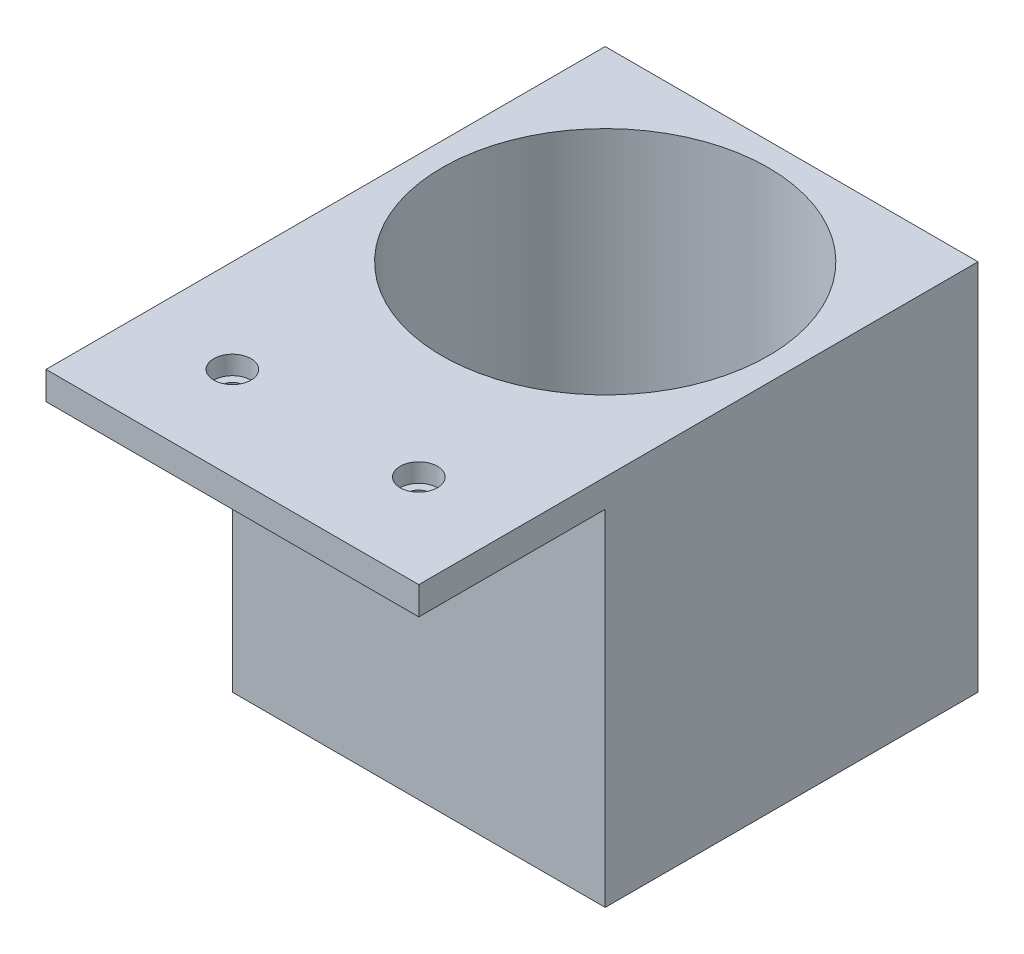
ISO-10303-21;
HEADER;
FILE_DESCRIPTION(('STEP AP214'),'2;1');
FILE_NAME('part.step','',(''),(''),'','','');
FILE_SCHEMA(('AUTOMOTIVE_DESIGN { 1 0 10303 214 1 1 1 1 }'));
ENDSEC;
DATA;
#1=APPLICATION_CONTEXT('core data for automotive mechanical design processes');
#2=APPLICATION_PROTOCOL_DEFINITION('international standard','automotive_design',2000,#1);
#3=PRODUCT_CONTEXT('',#1,'mechanical');
#4=PRODUCT('Part','Part','',(#3));
#5=PRODUCT_RELATED_PRODUCT_CATEGORY('part','',(#4));
#6=PRODUCT_DEFINITION_FORMATION('','',#4);
#7=PRODUCT_DEFINITION_CONTEXT('part definition',#1,'design');
#8=PRODUCT_DEFINITION('design','',#6,#7);
#9=PRODUCT_DEFINITION_SHAPE('','',#8);
#10=(LENGTH_UNIT() NAMED_UNIT(*) SI_UNIT(.MILLI.,.METRE.));
#11=(NAMED_UNIT(*) PLANE_ANGLE_UNIT() SI_UNIT($,.RADIAN.));
#12=(NAMED_UNIT(*) SI_UNIT($,.STERADIAN.) SOLID_ANGLE_UNIT());
#13=UNCERTAINTY_MEASURE_WITH_UNIT(LENGTH_MEASURE(1.E-05),#10,'distance_accuracy_value','');
#14=(GEOMETRIC_REPRESENTATION_CONTEXT(3) GLOBAL_UNCERTAINTY_ASSIGNED_CONTEXT((#13)) GLOBAL_UNIT_ASSIGNED_CONTEXT((#10,
#11,#12)) REPRESENTATION_CONTEXT('',''));
#15=CARTESIAN_POINT('',(0.,0.,0.));
#16=DIRECTION('',(0.,0.,1.));
#17=DIRECTION('',(1.,0.,0.));
#18=AXIS2_PLACEMENT_3D('',#15,#16,#17);
#19=CARTESIAN_POINT('',(80.,6.,0.));
#20=DIRECTION('',(0.,-1.,0.));
#21=DIRECTION('',(0.,0.,-1.));
#22=AXIS2_PLACEMENT_3D('',#19,#20,#21);
#23=PLANE('',#22);
#24=CARTESIAN_POINT('',(60.,6.,20.));
#25=DIRECTION('',(0.,1.,0.));
#26=DIRECTION('',(0.,0.,1.));
#27=AXIS2_PLACEMENT_3D('',#24,#25,#26);
#28=CIRCLE('',#27,3.99999999999999);
#29=CARTESIAN_POINT('',(60.,6.,24.));
#30=VERTEX_POINT('',#29);
#31=EDGE_CURVE('E196',#30,#30,#28,.T.);
#32=ORIENTED_EDGE('',*,*,#31,.F.);
#33=EDGE_LOOP('',(#32));
#34=FACE_BOUND('',#33,.T.);
#35=CARTESIAN_POINT('',(40.,6.00000000000001,-40.));
#36=DIRECTION('',(0.,-1.,0.));
#37=DIRECTION('',(0.,0.,-1.));
#38=AXIS2_PLACEMENT_3D('',#35,#36,#37);
#39=CIRCLE('',#38,35.);
#40=CARTESIAN_POINT('',(40.,6.00000000000001,-75.));
#41=VERTEX_POINT('',#40);
#42=EDGE_CURVE('E50',#41,#41,#39,.T.);
#43=ORIENTED_EDGE('',*,*,#42,.T.);
#44=EDGE_LOOP('',(#43));
#45=FACE_BOUND('',#44,.T.);
#46=DIRECTION('',(-1.,0.,0.));
#47=VECTOR('',#46,1.);
#48=CARTESIAN_POINT('',(80.,6.,40.));
#49=LINE('',#48,#47);
#50=CARTESIAN_POINT('',(80.,6.,40.));
#51=VERTEX_POINT('',#50);
#52=CARTESIAN_POINT('',(0.,6.,40.));
#53=VERTEX_POINT('',#52);
#54=EDGE_CURVE('E12',#51,#53,#49,.T.);
#55=ORIENTED_EDGE('',*,*,#54,.F.);
#56=DIRECTION('',(0.,0.,1.));
#57=VECTOR('',#56,1.);
#58=CARTESIAN_POINT('',(80.,6.,0.));
#59=LINE('',#58,#57);
#60=CARTESIAN_POINT('',(80.,6.00000000000001,-80.));
#61=VERTEX_POINT('',#60);
#62=EDGE_CURVE('E86',#61,#51,#59,.T.);
#63=ORIENTED_EDGE('',*,*,#62,.F.);
#64=DIRECTION('',(-1.,0.,0.));
#65=VECTOR('',#64,1.);
#66=CARTESIAN_POINT('',(0.,6.00000000000001,-80.));
#67=LINE('',#66,#65);
#68=CARTESIAN_POINT('',(0.,6.00000000000001,-80.));
#69=VERTEX_POINT('',#68);
#70=EDGE_CURVE('E130',#61,#69,#67,.T.);
#71=ORIENTED_EDGE('',*,*,#70,.T.);
#72=DIRECTION('',(0.,0.,1.));
#73=VECTOR('',#72,1.);
#74=CARTESIAN_POINT('',(0.,6.,0.));
#75=LINE('',#74,#73);
#76=EDGE_CURVE('E147',#69,#53,#75,.T.);
#77=ORIENTED_EDGE('',*,*,#76,.T.);
#78=EDGE_LOOP('',(#55,#63,#71,#77));
#79=FACE_BOUND('',#78,.T.);
#80=CARTESIAN_POINT('',(20.,6.,20.));
#81=DIRECTION('',(0.,1.,0.));
#82=DIRECTION('',(0.,0.,1.));
#83=AXIS2_PLACEMENT_3D('',#80,#81,#82);
#84=CIRCLE('',#83,3.99999999999999);
#85=CARTESIAN_POINT('',(20.,6.,24.));
#86=VERTEX_POINT('',#85);
#87=EDGE_CURVE('E203',#86,#86,#84,.T.);
#88=ORIENTED_EDGE('',*,*,#87,.F.);
#89=EDGE_LOOP('',(#88));
#90=FACE_BOUND('',#89,.T.);
#91=ADVANCED_FACE('F47',(#34,#45,#79,#90),#23,.F.);
#92=CARTESIAN_POINT('',(80.,0.,40.));
#93=DIRECTION('',(0.,0.,1.));
#94=DIRECTION('',(1.,0.,0.));
#95=AXIS2_PLACEMENT_3D('',#92,#93,#94);
#96=PLANE('',#95);
#97=DIRECTION('',(0.,1.,0.));
#98=VECTOR('',#97,1.);
#99=CARTESIAN_POINT('',(0.,0.,40.));
#100=LINE('',#99,#98);
#101=CARTESIAN_POINT('',(0.,0.,40.));
#102=VERTEX_POINT('',#101);
#103=EDGE_CURVE('E164',#102,#53,#100,.T.);
#104=ORIENTED_EDGE('',*,*,#103,.F.);
#105=DIRECTION('',(-1.,0.,0.));
#106=VECTOR('',#105,1.);
#107=CARTESIAN_POINT('',(80.,0.,40.));
#108=LINE('',#107,#106);
#109=CARTESIAN_POINT('',(80.,0.,40.));
#110=VERTEX_POINT('',#109);
#111=EDGE_CURVE('E57',#110,#102,#108,.T.);
#112=ORIENTED_EDGE('',*,*,#111,.F.);
#113=DIRECTION('',(0.,1.,0.));
#114=VECTOR('',#113,1.);
#115=CARTESIAN_POINT('',(80.,0.,40.));
#116=LINE('',#115,#114);
#117=EDGE_CURVE('E152',#110,#51,#116,.T.);
#118=ORIENTED_EDGE('',*,*,#117,.T.);
#119=ORIENTED_EDGE('',*,*,#54,.T.);
#120=EDGE_LOOP('',(#104,#112,#118,#119));
#121=FACE_BOUND('',#120,.T.);
#122=ADVANCED_FACE('F175',(#121),#96,.T.);
#123=CARTESIAN_POINT('',(80.,0.,0.));
#124=DIRECTION('',(0.,-1.,0.));
#125=DIRECTION('',(0.,0.,-1.));
#126=AXIS2_PLACEMENT_3D('',#123,#124,#125);
#127=PLANE('',#126);
#128=CARTESIAN_POINT('',(20.,0.,20.));
#129=DIRECTION('',(0.,-1.,0.));
#130=DIRECTION('',(0.,0.,-1.));
#131=AXIS2_PLACEMENT_3D('',#128,#129,#130);
#132=CIRCLE('',#131,2.25);
#133=CARTESIAN_POINT('',(20.,0.,17.75));
#134=VERTEX_POINT('',#133);
#135=EDGE_CURVE('E216',#134,#134,#132,.T.);
#136=ORIENTED_EDGE('',*,*,#135,.F.);
#137=EDGE_LOOP('',(#136));
#138=FACE_BOUND('',#137,.T.);
#139=CARTESIAN_POINT('',(60.,0.,20.));
#140=DIRECTION('',(0.,-1.,0.));
#141=DIRECTION('',(0.,0.,-1.));
#142=AXIS2_PLACEMENT_3D('',#139,#140,#141);
#143=CIRCLE('',#142,2.25);
#144=CARTESIAN_POINT('',(60.,0.,17.75));
#145=VERTEX_POINT('',#144);
#146=EDGE_CURVE('E229',#145,#145,#143,.T.);
#147=ORIENTED_EDGE('',*,*,#146,.F.);
#148=EDGE_LOOP('',(#147));
#149=FACE_BOUND('',#148,.T.);
#150=DIRECTION('',(0.,0.,1.));
#151=VECTOR('',#150,1.);
#152=CARTESIAN_POINT('',(0.,0.,0.));
#153=LINE('',#152,#151);
#154=CARTESIAN_POINT('',(0.,0.,0.));
#155=VERTEX_POINT('',#154);
#156=EDGE_CURVE('E113',#155,#102,#153,.T.);
#157=ORIENTED_EDGE('',*,*,#156,.F.);
#158=DIRECTION('',(-1.,0.,0.));
#159=VECTOR('',#158,1.);
#160=CARTESIAN_POINT('',(80.,0.,0.));
#161=LINE('',#160,#159);
#162=CARTESIAN_POINT('',(80.,0.,0.));
#163=VERTEX_POINT('',#162);
#164=EDGE_CURVE('E65',#163,#155,#161,.T.);
#165=ORIENTED_EDGE('',*,*,#164,.F.);
#166=DIRECTION('',(0.,0.,1.));
#167=VECTOR('',#166,1.);
#168=CARTESIAN_POINT('',(80.,0.,0.));
#169=LINE('',#168,#167);
#170=EDGE_CURVE('E156',#163,#110,#169,.T.);
#171=ORIENTED_EDGE('',*,*,#170,.T.);
#172=ORIENTED_EDGE('',*,*,#111,.T.);
#173=EDGE_LOOP('',(#157,#165,#171,#172));
#174=FACE_BOUND('',#173,.T.);
#175=ADVANCED_FACE('F173',(#138,#149,#174),#127,.T.);
#176=CARTESIAN_POINT('',(80.,-40.,0.));
#177=DIRECTION('',(0.,0.,1.));
#178=DIRECTION('',(1.,0.,0.));
#179=AXIS2_PLACEMENT_3D('',#176,#177,#178);
#180=PLANE('',#179);
#181=DIRECTION('',(0.,1.,0.));
#182=VECTOR('',#181,1.);
#183=CARTESIAN_POINT('',(0.,-40.,0.));
#184=LINE('',#183,#182);
#185=CARTESIAN_POINT('',(0.,-74.,0.));
#186=VERTEX_POINT('',#185);
#187=EDGE_CURVE('E105',#186,#155,#184,.T.);
#188=ORIENTED_EDGE('',*,*,#187,.F.);
#189=DIRECTION('',(1.,0.,0.));
#190=VECTOR('',#189,1.);
#191=CARTESIAN_POINT('',(0.,-74.,0.));
#192=LINE('',#191,#190);
#193=CARTESIAN_POINT('',(80.,-74.,0.));
#194=VERTEX_POINT('',#193);
#195=EDGE_CURVE('E108',#186,#194,#192,.T.);
#196=ORIENTED_EDGE('',*,*,#195,.T.);
#197=DIRECTION('',(0.,1.,0.));
#198=VECTOR('',#197,1.);
#199=CARTESIAN_POINT('',(80.,-40.,0.));
#200=LINE('',#199,#198);
#201=EDGE_CURVE('E159',#194,#163,#200,.T.);
#202=ORIENTED_EDGE('',*,*,#201,.T.);
#203=ORIENTED_EDGE('',*,*,#164,.T.);
#204=EDGE_LOOP('',(#188,#196,#202,#203));
#205=FACE_BOUND('',#204,.T.);
#206=ADVANCED_FACE('F107',(#205),#180,.T.);
#207=CARTESIAN_POINT('',(80.,0.,0.));
#208=DIRECTION('',(-1.,0.,0.));
#209=DIRECTION('',(0.,0.,1.));
#210=AXIS2_PLACEMENT_3D('',#207,#208,#209);
#211=PLANE('',#210);
#212=ORIENTED_EDGE('',*,*,#201,.F.);
#213=DIRECTION('',(0.,0.,-1.));
#214=VECTOR('',#213,1.);
#215=CARTESIAN_POINT('',(80.,-74.,0.));
#216=LINE('',#215,#214);
#217=CARTESIAN_POINT('',(80.,-74.,-80.));
#218=VERTEX_POINT('',#217);
#219=EDGE_CURVE('E123',#194,#218,#216,.T.);
#220=ORIENTED_EDGE('',*,*,#219,.T.);
#221=DIRECTION('',(0.,1.,0.));
#222=VECTOR('',#221,1.);
#223=CARTESIAN_POINT('',(80.,-74.,-80.));
#224=LINE('',#223,#222);
#225=EDGE_CURVE('E143',#218,#61,#224,.T.);
#226=ORIENTED_EDGE('',*,*,#225,.T.);
#227=ORIENTED_EDGE('',*,*,#62,.T.);
#228=ORIENTED_EDGE('',*,*,#117,.F.);
#229=ORIENTED_EDGE('',*,*,#170,.F.);
#230=EDGE_LOOP('',(#212,#220,#226,#227,#228,#229));
#231=FACE_BOUND('',#230,.T.);
#232=ADVANCED_FACE('F183',(#231),#211,.F.);
#233=CARTESIAN_POINT('',(0.,0.,0.));
#234=DIRECTION('',(-1.,0.,0.));
#235=DIRECTION('',(0.,0.,1.));
#236=AXIS2_PLACEMENT_3D('',#233,#234,#235);
#237=PLANE('',#236);
#238=DIRECTION('',(0.,0.,1.));
#239=VECTOR('',#238,1.);
#240=CARTESIAN_POINT('',(0.,-74.,0.));
#241=LINE('',#240,#239);
#242=CARTESIAN_POINT('',(0.,-74.,-80.));
#243=VERTEX_POINT('',#242);
#244=EDGE_CURVE('E120',#243,#186,#241,.T.);
#245=ORIENTED_EDGE('',*,*,#244,.T.);
#246=ORIENTED_EDGE('',*,*,#187,.T.);
#247=ORIENTED_EDGE('',*,*,#156,.T.);
#248=ORIENTED_EDGE('',*,*,#103,.T.);
#249=ORIENTED_EDGE('',*,*,#76,.F.);
#250=DIRECTION('',(0.,1.,0.));
#251=VECTOR('',#250,1.);
#252=CARTESIAN_POINT('',(0.,-74.,-80.));
#253=LINE('',#252,#251);
#254=EDGE_CURVE('E128',#243,#69,#253,.T.);
#255=ORIENTED_EDGE('',*,*,#254,.F.);
#256=EDGE_LOOP('',(#245,#246,#247,#248,#249,#255));
#257=FACE_BOUND('',#256,.T.);
#258=ADVANCED_FACE('F126',(#257),#237,.T.);
#259=CARTESIAN_POINT('',(0.,-74.,-80.));
#260=DIRECTION('',(0.,0.,-1.));
#261=DIRECTION('',(0.,1.,0.));
#262=AXIS2_PLACEMENT_3D('',#259,#260,#261);
#263=PLANE('',#262);
#264=ORIENTED_EDGE('',*,*,#70,.F.);
#265=ORIENTED_EDGE('',*,*,#225,.F.);
#266=DIRECTION('',(-1.,0.,0.));
#267=VECTOR('',#266,1.);
#268=CARTESIAN_POINT('',(0.,-74.,-80.));
#269=LINE('',#268,#267);
#270=EDGE_CURVE('E141',#218,#243,#269,.T.);
#271=ORIENTED_EDGE('',*,*,#270,.T.);
#272=ORIENTED_EDGE('',*,*,#254,.T.);
#273=EDGE_LOOP('',(#264,#265,#271,#272));
#274=FACE_BOUND('',#273,.T.);
#275=ADVANCED_FACE('F250',(#274),#263,.T.);
#276=CARTESIAN_POINT('',(0.,-74.,0.));
#277=DIRECTION('',(0.,-1.,0.));
#278=DIRECTION('',(0.,0.,-1.));
#279=AXIS2_PLACEMENT_3D('',#276,#277,#278);
#280=PLANE('',#279);
#281=ORIENTED_EDGE('',*,*,#244,.F.);
#282=ORIENTED_EDGE('',*,*,#270,.F.);
#283=ORIENTED_EDGE('',*,*,#219,.F.);
#284=ORIENTED_EDGE('',*,*,#195,.F.);
#285=EDGE_LOOP('',(#281,#282,#283,#284));
#286=FACE_BOUND('',#285,.T.);
#287=ADVANCED_FACE('F118',(#286),#280,.T.);
#288=CARTESIAN_POINT('',(40.,-172.994949366117,-40.));
#289=DIRECTION('',(0.,1.,0.));
#290=DIRECTION('',(0.,0.,1.));
#291=AXIS2_PLACEMENT_3D('',#288,#289,#290);
#292=CYLINDRICAL_SURFACE('',#291,35.);
#293=CARTESIAN_POINT('',(40.,-68.,-40.));
#294=DIRECTION('',(0.,-1.,0.));
#295=DIRECTION('',(0.,0.,-1.));
#296=AXIS2_PLACEMENT_3D('',#293,#294,#295);
#297=CIRCLE('',#296,35.);
#298=CARTESIAN_POINT('',(40.,-68.,-75.));
#299=VERTEX_POINT('',#298);
#300=EDGE_CURVE('E136',#299,#299,#297,.F.);
#301=ORIENTED_EDGE('',*,*,#300,.F.);
#302=EDGE_LOOP('',(#301));
#303=FACE_BOUND('',#302,.T.);
#304=ORIENTED_EDGE('',*,*,#42,.F.);
#305=EDGE_LOOP('',(#304));
#306=FACE_BOUND('',#305,.T.);
#307=ADVANCED_FACE('F241',(#303,#306),#292,.F.);
#308=CARTESIAN_POINT('',(0.,-68.,0.));
#309=DIRECTION('',(0.,-1.,0.));
#310=DIRECTION('',(0.,0.,-1.));
#311=AXIS2_PLACEMENT_3D('',#308,#309,#310);
#312=PLANE('',#311);
#313=ORIENTED_EDGE('',*,*,#300,.T.);
#314=EDGE_LOOP('',(#313));
#315=FACE_BOUND('',#314,.T.);
#316=ADVANCED_FACE('F239',(#315),#312,.F.);
#317=CARTESIAN_POINT('',(60.,6.,20.));
#318=DIRECTION('',(0.,1.,0.));
#319=DIRECTION('',(0.,0.,1.));
#320=AXIS2_PLACEMENT_3D('',#317,#318,#319);
#321=CYLINDRICAL_SURFACE('',#320,2.25);
#322=CARTESIAN_POINT('',(60.,2.,20.));
#323=DIRECTION('',(0.,1.,0.));
#324=DIRECTION('',(0.,0.,1.));
#325=AXIS2_PLACEMENT_3D('',#322,#323,#324);
#326=CIRCLE('',#325,2.25);
#327=CARTESIAN_POINT('',(60.,2.,22.25));
#328=VERTEX_POINT('',#327);
#329=EDGE_CURVE('E226',#328,#328,#326,.T.);
#330=ORIENTED_EDGE('',*,*,#329,.T.);
#331=EDGE_LOOP('',(#330));
#332=FACE_BOUND('',#331,.T.);
#333=ORIENTED_EDGE('',*,*,#146,.T.);
#334=EDGE_LOOP('',(#333));
#335=FACE_BOUND('',#334,.T.);
#336=ADVANCED_FACE('F248',(#332,#335),#321,.F.);
#337=CARTESIAN_POINT('',(62.25,2.,20.));
#338=DIRECTION('',(0.,-1.,0.));
#339=DIRECTION('',(0.,0.,-1.));
#340=AXIS2_PLACEMENT_3D('',#337,#338,#339);
#341=PLANE('',#340);
#342=ORIENTED_EDGE('',*,*,#329,.F.);
#343=EDGE_LOOP('',(#342));
#344=FACE_BOUND('',#343,.T.);
#345=CARTESIAN_POINT('',(60.,2.,20.));
#346=DIRECTION('',(0.,1.,0.));
#347=DIRECTION('',(0.,0.,1.));
#348=AXIS2_PLACEMENT_3D('',#345,#346,#347);
#349=CIRCLE('',#348,4.);
#350=CARTESIAN_POINT('',(60.,2.,24.));
#351=VERTEX_POINT('',#350);
#352=EDGE_CURVE('E222',#351,#351,#349,.T.);
#353=ORIENTED_EDGE('',*,*,#352,.T.);
#354=EDGE_LOOP('',(#353));
#355=FACE_BOUND('',#354,.T.);
#356=ADVANCED_FACE('F301',(#344,#355),#341,.F.);
#357=CARTESIAN_POINT('',(60.,6.,20.));
#358=DIRECTION('',(0.,1.,0.));
#359=DIRECTION('',(0.,0.,1.));
#360=AXIS2_PLACEMENT_3D('',#357,#358,#359);
#361=CYLINDRICAL_SURFACE('',#360,4.);
#362=ORIENTED_EDGE('',*,*,#352,.F.);
#363=EDGE_LOOP('',(#362));
#364=FACE_BOUND('',#363,.T.);
#365=ORIENTED_EDGE('',*,*,#31,.T.);
#366=EDGE_LOOP('',(#365));
#367=FACE_BOUND('',#366,.T.);
#368=ADVANCED_FACE('F310',(#364,#367),#361,.F.);
#369=CARTESIAN_POINT('',(20.,6.,20.));
#370=DIRECTION('',(0.,1.,0.));
#371=DIRECTION('',(0.,0.,1.));
#372=AXIS2_PLACEMENT_3D('',#369,#370,#371);
#373=CYLINDRICAL_SURFACE('',#372,2.25);
#374=CARTESIAN_POINT('',(20.,2.,20.));
#375=DIRECTION('',(0.,1.,0.));
#376=DIRECTION('',(0.,0.,1.));
#377=AXIS2_PLACEMENT_3D('',#374,#375,#376);
#378=CIRCLE('',#377,2.25);
#379=CARTESIAN_POINT('',(20.,2.,22.25));
#380=VERTEX_POINT('',#379);
#381=EDGE_CURVE('E210',#380,#380,#378,.T.);
#382=ORIENTED_EDGE('',*,*,#381,.T.);
#383=EDGE_LOOP('',(#382));
#384=FACE_BOUND('',#383,.T.);
#385=ORIENTED_EDGE('',*,*,#135,.T.);
#386=EDGE_LOOP('',(#385));
#387=FACE_BOUND('',#386,.T.);
#388=ADVANCED_FACE('F319',(#384,#387),#373,.F.);
#389=CARTESIAN_POINT('',(22.25,2.,20.));
#390=DIRECTION('',(0.,-1.,0.));
#391=DIRECTION('',(0.,0.,-1.));
#392=AXIS2_PLACEMENT_3D('',#389,#390,#391);
#393=PLANE('',#392);
#394=ORIENTED_EDGE('',*,*,#381,.F.);
#395=EDGE_LOOP('',(#394));
#396=FACE_BOUND('',#395,.T.);
#397=CARTESIAN_POINT('',(20.,2.,20.));
#398=DIRECTION('',(0.,1.,0.));
#399=DIRECTION('',(0.,0.,1.));
#400=AXIS2_PLACEMENT_3D('',#397,#398,#399);
#401=CIRCLE('',#400,4.);
#402=CARTESIAN_POINT('',(20.,2.,24.));
#403=VERTEX_POINT('',#402);
#404=EDGE_CURVE('E206',#403,#403,#401,.T.);
#405=ORIENTED_EDGE('',*,*,#404,.T.);
#406=EDGE_LOOP('',(#405));
#407=FACE_BOUND('',#406,.T.);
#408=ADVANCED_FACE('F329',(#396,#407),#393,.F.);
#409=CARTESIAN_POINT('',(20.,6.,20.));
#410=DIRECTION('',(0.,1.,0.));
#411=DIRECTION('',(0.,0.,1.));
#412=AXIS2_PLACEMENT_3D('',#409,#410,#411);
#413=CYLINDRICAL_SURFACE('',#412,3.99999999999999);
#414=ORIENTED_EDGE('',*,*,#404,.F.);
#415=EDGE_LOOP('',(#414));
#416=FACE_BOUND('',#415,.T.);
#417=ORIENTED_EDGE('',*,*,#87,.T.);
#418=EDGE_LOOP('',(#417));
#419=FACE_BOUND('',#418,.T.);
#420=ADVANCED_FACE('F339',(#416,#419),#413,.F.);
#421=CLOSED_SHELL('',(#91,#122,#175,#206,#232,#258,#275,#287,#307,#316,#336,#356,#368,#388,#408,#420));
#422=MANIFOLD_SOLID_BREP('B2',#421);
#423=ADVANCED_BREP_SHAPE_REPRESENTATION('',(#18,#422),#14);
#424=SHAPE_DEFINITION_REPRESENTATION(#9,#423);
ENDSEC;
END-ISO-10303-21;
